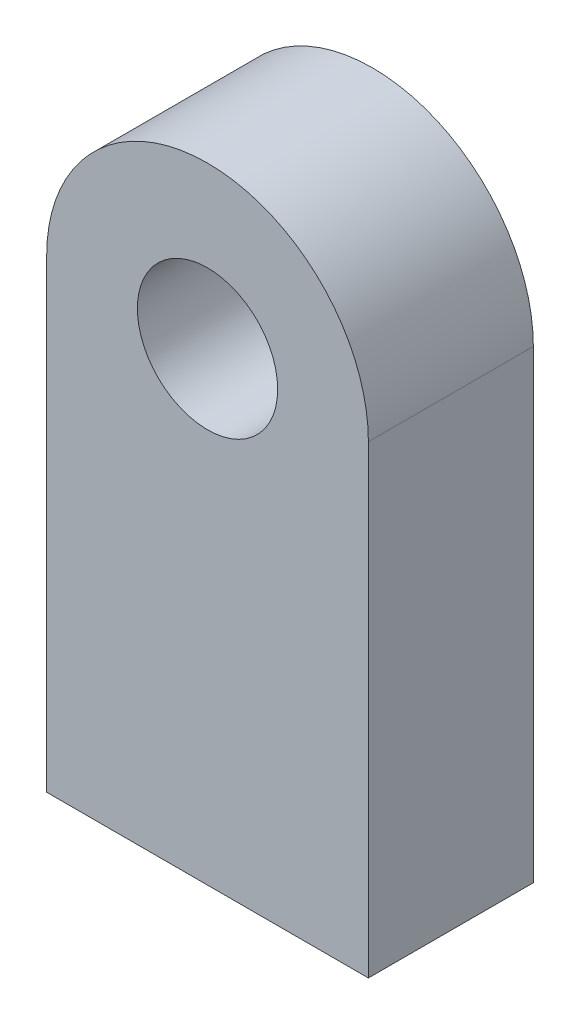
ISO-10303-21;
HEADER;
FILE_DESCRIPTION(('STEP AP214'),'2;1');
FILE_NAME('part.step','',(''),(''),'','','');
FILE_SCHEMA(('AUTOMOTIVE_DESIGN { 1 0 10303 214 1 1 1 1 }'));
ENDSEC;
DATA;
#1=APPLICATION_CONTEXT('core data for automotive mechanical design processes');
#2=APPLICATION_PROTOCOL_DEFINITION('international standard','automotive_design',2000,#1);
#3=PRODUCT_CONTEXT('',#1,'mechanical');
#4=PRODUCT('Part','Part','',(#3));
#5=PRODUCT_RELATED_PRODUCT_CATEGORY('part','',(#4));
#6=PRODUCT_DEFINITION_FORMATION('','',#4);
#7=PRODUCT_DEFINITION_CONTEXT('part definition',#1,'design');
#8=PRODUCT_DEFINITION('design','',#6,#7);
#9=PRODUCT_DEFINITION_SHAPE('','',#8);
#10=(LENGTH_UNIT() NAMED_UNIT(*) SI_UNIT(.MILLI.,.METRE.));
#11=(NAMED_UNIT(*) PLANE_ANGLE_UNIT() SI_UNIT($,.RADIAN.));
#12=(NAMED_UNIT(*) SI_UNIT($,.STERADIAN.) SOLID_ANGLE_UNIT());
#13=UNCERTAINTY_MEASURE_WITH_UNIT(LENGTH_MEASURE(1.E-05),#10,'distance_accuracy_value','');
#14=(GEOMETRIC_REPRESENTATION_CONTEXT(3) GLOBAL_UNCERTAINTY_ASSIGNED_CONTEXT((#13)) GLOBAL_UNIT_ASSIGNED_CONTEXT((#10,
#11,#12)) REPRESENTATION_CONTEXT('',''));
#15=CARTESIAN_POINT('',(0.,0.,0.));
#16=DIRECTION('',(0.,0.,1.));
#17=DIRECTION('',(1.,0.,0.));
#18=AXIS2_PLACEMENT_3D('',#15,#16,#17);
#19=CARTESIAN_POINT('',(0.,28.1571337172105,5.));
#20=DIRECTION('',(0.,0.,-1.));
#21=DIRECTION('',(-1.,0.,0.));
#22=AXIS2_PLACEMENT_3D('',#19,#20,#21);
#23=PLANE('',#22);
#24=DIRECTION('',(0.,-1.,0.));
#25=VECTOR('',#24,1.);
#26=CARTESIAN_POINT('',(-9.75234058434635,0.,5.));
#27=LINE('',#26,#25);
#28=CARTESIAN_POINT('',(-9.75234058434636,28.1571337172105,5.));
#29=VERTEX_POINT('',#28);
#30=CARTESIAN_POINT('',(-9.75234058434635,0.,5.));
#31=VERTEX_POINT('',#30);
#32=EDGE_CURVE('E103',#29,#31,#27,.T.);
#33=ORIENTED_EDGE('',*,*,#32,.T.);
#34=DIRECTION('',(1.,0.,0.));
#35=VECTOR('',#34,1.);
#36=CARTESIAN_POINT('',(-9.75234058434635,0.,5.));
#37=LINE('',#36,#35);
#38=CARTESIAN_POINT('',(9.75234058434633,0.,5.));
#39=VERTEX_POINT('',#38);
#40=EDGE_CURVE('E88',#31,#39,#37,.T.);
#41=ORIENTED_EDGE('',*,*,#40,.T.);
#42=DIRECTION('',(0.,1.,0.));
#43=VECTOR('',#42,1.);
#44=CARTESIAN_POINT('',(9.75234058434633,0.,5.));
#45=LINE('',#44,#43);
#46=CARTESIAN_POINT('',(9.75234058434633,28.1571337172105,5.));
#47=VERTEX_POINT('',#46);
#48=EDGE_CURVE('E54',#39,#47,#45,.T.);
#49=ORIENTED_EDGE('',*,*,#48,.T.);
#50=CARTESIAN_POINT('',(0.,28.1571337172105,5.));
#51=DIRECTION('',(0.,0.,1.));
#52=DIRECTION('',(-1.,0.,0.));
#53=AXIS2_PLACEMENT_3D('',#50,#51,#52);
#54=CIRCLE('',#53,9.75234058434634);
#55=EDGE_CURVE('E49',#47,#29,#54,.T.);
#56=ORIENTED_EDGE('',*,*,#55,.T.);
#57=EDGE_LOOP('',(#33,#41,#49,#56));
#58=FACE_BOUND('',#57,.T.);
#59=CARTESIAN_POINT('',(0.,28.1571337172105,5.));
#60=DIRECTION('',(0.,0.,1.));
#61=DIRECTION('',(1.,0.,0.));
#62=AXIS2_PLACEMENT_3D('',#59,#60,#61);
#63=CIRCLE('',#62,4.25290040520367);
#64=CARTESIAN_POINT('',(4.25290040520365,28.1571337172105,5.));
#65=VERTEX_POINT('',#64);
#66=EDGE_CURVE('E93',#65,#65,#63,.T.);
#67=ORIENTED_EDGE('',*,*,#66,.F.);
#68=EDGE_LOOP('',(#67));
#69=FACE_BOUND('',#68,.T.);
#70=ADVANCED_FACE('F34',(#58,#69),#23,.F.);
#71=CARTESIAN_POINT('',(0.,28.1571337172105,-5.));
#72=DIRECTION('',(0.,0.,-1.));
#73=DIRECTION('',(-1.,0.,0.));
#74=AXIS2_PLACEMENT_3D('',#71,#72,#73);
#75=PLANE('',#74);
#76=DIRECTION('',(0.,-1.,0.));
#77=VECTOR('',#76,1.);
#78=CARTESIAN_POINT('',(-9.75234058434635,0.,-5.));
#79=LINE('',#78,#77);
#80=CARTESIAN_POINT('',(-9.75234058434636,28.1571337172105,-5.));
#81=VERTEX_POINT('',#80);
#82=CARTESIAN_POINT('',(-9.75234058434635,0.,-5.));
#83=VERTEX_POINT('',#82);
#84=EDGE_CURVE('E80',#81,#83,#79,.T.);
#85=ORIENTED_EDGE('',*,*,#84,.F.);
#86=CARTESIAN_POINT('',(0.,28.1571337172105,-5.));
#87=DIRECTION('',(0.,0.,1.));
#88=DIRECTION('',(-1.,0.,0.));
#89=AXIS2_PLACEMENT_3D('',#86,#87,#88);
#90=CIRCLE('',#89,9.75234058434634);
#91=CARTESIAN_POINT('',(9.75234058434633,28.1571337172105,-5.));
#92=VERTEX_POINT('',#91);
#93=EDGE_CURVE('E101',#92,#81,#90,.T.);
#94=ORIENTED_EDGE('',*,*,#93,.F.);
#95=DIRECTION('',(0.,1.,0.));
#96=VECTOR('',#95,1.);
#97=CARTESIAN_POINT('',(9.75234058434633,0.,-5.));
#98=LINE('',#97,#96);
#99=CARTESIAN_POINT('',(9.75234058434633,0.,-5.));
#100=VERTEX_POINT('',#99);
#101=EDGE_CURVE('E81',#100,#92,#98,.T.);
#102=ORIENTED_EDGE('',*,*,#101,.F.);
#103=DIRECTION('',(1.,0.,0.));
#104=VECTOR('',#103,1.);
#105=CARTESIAN_POINT('',(-9.75234058434635,0.,-5.));
#106=LINE('',#105,#104);
#107=EDGE_CURVE('E75',#83,#100,#106,.T.);
#108=ORIENTED_EDGE('',*,*,#107,.F.);
#109=EDGE_LOOP('',(#85,#94,#102,#108));
#110=FACE_BOUND('',#109,.T.);
#111=CARTESIAN_POINT('',(0.,28.1571337172105,-5.));
#112=DIRECTION('',(0.,0.,1.));
#113=DIRECTION('',(1.,0.,0.));
#114=AXIS2_PLACEMENT_3D('',#111,#112,#113);
#115=CIRCLE('',#114,4.25290040520367);
#116=CARTESIAN_POINT('',(4.25290040520365,28.1571337172105,-5.));
#117=VERTEX_POINT('',#116);
#118=EDGE_CURVE('E96',#117,#117,#115,.T.);
#119=ORIENTED_EDGE('',*,*,#118,.T.);
#120=EDGE_LOOP('',(#119));
#121=FACE_BOUND('',#120,.T.);
#122=ADVANCED_FACE('F76',(#110,#121),#75,.T.);
#123=CARTESIAN_POINT('',(-9.75234058434635,0.,5.));
#124=DIRECTION('',(1.,0.,0.));
#125=DIRECTION('',(0.,0.,-1.));
#126=AXIS2_PLACEMENT_3D('',#123,#124,#125);
#127=PLANE('',#126);
#128=ORIENTED_EDGE('',*,*,#84,.T.);
#129=DIRECTION('',(0.,0.,-1.));
#130=VECTOR('',#129,1.);
#131=CARTESIAN_POINT('',(-9.75234058434635,0.,5.));
#132=LINE('',#131,#130);
#133=EDGE_CURVE('E11',#31,#83,#132,.T.);
#134=ORIENTED_EDGE('',*,*,#133,.F.);
#135=ORIENTED_EDGE('',*,*,#32,.F.);
#136=DIRECTION('',(0.,0.,-1.));
#137=VECTOR('',#136,1.);
#138=CARTESIAN_POINT('',(-9.75234058434636,28.1571337172105,5.));
#139=LINE('',#138,#137);
#140=EDGE_CURVE('E92',#29,#81,#139,.T.);
#141=ORIENTED_EDGE('',*,*,#140,.T.);
#142=EDGE_LOOP('',(#128,#134,#135,#141));
#143=FACE_BOUND('',#142,.T.);
#144=ADVANCED_FACE('F36',(#143),#127,.F.);
#145=CARTESIAN_POINT('',(-9.75234058434635,0.,5.));
#146=DIRECTION('',(0.,1.,0.));
#147=DIRECTION('',(0.,0.,1.));
#148=AXIS2_PLACEMENT_3D('',#145,#146,#147);
#149=PLANE('',#148);
#150=ORIENTED_EDGE('',*,*,#107,.T.);
#151=DIRECTION('',(0.,0.,-1.));
#152=VECTOR('',#151,1.);
#153=CARTESIAN_POINT('',(9.75234058434633,0.,5.));
#154=LINE('',#153,#152);
#155=EDGE_CURVE('E42',#39,#100,#154,.T.);
#156=ORIENTED_EDGE('',*,*,#155,.F.);
#157=ORIENTED_EDGE('',*,*,#40,.F.);
#158=ORIENTED_EDGE('',*,*,#133,.T.);
#159=EDGE_LOOP('',(#150,#156,#157,#158));
#160=FACE_BOUND('',#159,.T.);
#161=ADVANCED_FACE('F87',(#160),#149,.F.);
#162=CARTESIAN_POINT('',(9.75234058434633,0.,5.));
#163=DIRECTION('',(-1.,0.,0.));
#164=DIRECTION('',(0.,0.,1.));
#165=AXIS2_PLACEMENT_3D('',#162,#163,#164);
#166=PLANE('',#165);
#167=ORIENTED_EDGE('',*,*,#101,.T.);
#168=DIRECTION('',(0.,0.,-1.));
#169=VECTOR('',#168,1.);
#170=CARTESIAN_POINT('',(9.75234058434633,28.1571337172105,5.));
#171=LINE('',#170,#169);
#172=EDGE_CURVE('E109',#47,#92,#171,.T.);
#173=ORIENTED_EDGE('',*,*,#172,.F.);
#174=ORIENTED_EDGE('',*,*,#48,.F.);
#175=ORIENTED_EDGE('',*,*,#155,.T.);
#176=EDGE_LOOP('',(#167,#173,#174,#175));
#177=FACE_BOUND('',#176,.T.);
#178=ADVANCED_FACE('F112',(#177),#166,.F.);
#179=CARTESIAN_POINT('',(0.,28.1571337172105,5.));
#180=DIRECTION('',(0.,0.,-1.));
#181=DIRECTION('',(-1.,0.,0.));
#182=AXIS2_PLACEMENT_3D('',#179,#180,#181);
#183=CYLINDRICAL_SURFACE('',#182,9.75234058434634);
#184=ORIENTED_EDGE('',*,*,#93,.T.);
#185=ORIENTED_EDGE('',*,*,#140,.F.);
#186=ORIENTED_EDGE('',*,*,#55,.F.);
#187=ORIENTED_EDGE('',*,*,#172,.T.);
#188=EDGE_LOOP('',(#184,#185,#186,#187));
#189=FACE_BOUND('',#188,.T.);
#190=ADVANCED_FACE('F114',(#189),#183,.T.);
#191=CARTESIAN_POINT('',(0.,28.1571337172105,5.));
#192=DIRECTION('',(0.,0.,-1.));
#193=DIRECTION('',(-1.,0.,0.));
#194=AXIS2_PLACEMENT_3D('',#191,#192,#193);
#195=CYLINDRICAL_SURFACE('',#194,4.25290040520367);
#196=ORIENTED_EDGE('',*,*,#66,.T.);
#197=EDGE_LOOP('',(#196));
#198=FACE_BOUND('',#197,.T.);
#199=ORIENTED_EDGE('',*,*,#118,.F.);
#200=EDGE_LOOP('',(#199));
#201=FACE_BOUND('',#200,.T.);
#202=ADVANCED_FACE('F120',(#198,#201),#195,.F.);
#203=CLOSED_SHELL('',(#70,#122,#144,#161,#178,#190,#202));
#204=MANIFOLD_SOLID_BREP('B2',#203);
#205=ADVANCED_BREP_SHAPE_REPRESENTATION('',(#18,#204),#14);
#206=SHAPE_DEFINITION_REPRESENTATION(#9,#205);
ENDSEC;
END-ISO-10303-21;
